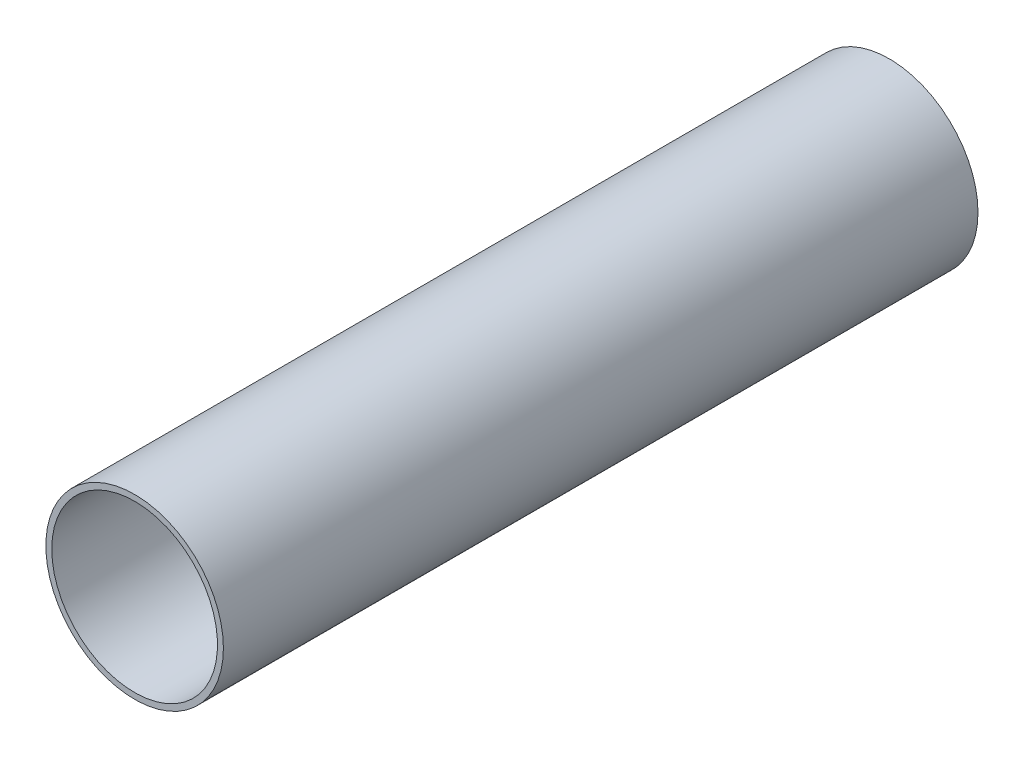
ISO-10303-21;
HEADER;
FILE_DESCRIPTION(('STEP AP214'),'2;1');
FILE_NAME('part.step','',(''),(''),'','','');
FILE_SCHEMA(('AUTOMOTIVE_DESIGN { 1 0 10303 214 1 1 1 1 }'));
ENDSEC;
DATA;
#1=APPLICATION_CONTEXT('core data for automotive mechanical design processes');
#2=APPLICATION_PROTOCOL_DEFINITION('international standard','automotive_design',2000,#1);
#3=PRODUCT_CONTEXT('',#1,'mechanical');
#4=PRODUCT('Part','Part','',(#3));
#5=PRODUCT_RELATED_PRODUCT_CATEGORY('part','',(#4));
#6=PRODUCT_DEFINITION_FORMATION('','',#4);
#7=PRODUCT_DEFINITION_CONTEXT('part definition',#1,'design');
#8=PRODUCT_DEFINITION('design','',#6,#7);
#9=PRODUCT_DEFINITION_SHAPE('','',#8);
#10=(LENGTH_UNIT() NAMED_UNIT(*) SI_UNIT(.MILLI.,.METRE.));
#11=(NAMED_UNIT(*) PLANE_ANGLE_UNIT() SI_UNIT($,.RADIAN.));
#12=(NAMED_UNIT(*) SI_UNIT($,.STERADIAN.) SOLID_ANGLE_UNIT());
#13=UNCERTAINTY_MEASURE_WITH_UNIT(LENGTH_MEASURE(1.E-05),#10,'distance_accuracy_value','');
#14=(GEOMETRIC_REPRESENTATION_CONTEXT(3) GLOBAL_UNCERTAINTY_ASSIGNED_CONTEXT((#13)) GLOBAL_UNIT_ASSIGNED_CONTEXT((#10,
#11,#12)) REPRESENTATION_CONTEXT('',''));
#15=CARTESIAN_POINT('',(0.,0.,0.));
#16=DIRECTION('',(0.,0.,1.));
#17=DIRECTION('',(1.,0.,0.));
#18=AXIS2_PLACEMENT_3D('',#15,#16,#17);
#19=CARTESIAN_POINT('',(-13.8868166566674,18.2655426294905,431.8));
#20=DIRECTION('',(0.,0.,-1.));
#21=DIRECTION('',(-1.,0.,0.));
#22=AXIS2_PLACEMENT_3D('',#19,#20,#21);
#23=CYLINDRICAL_SURFACE('',#22,50.8);
#24=CARTESIAN_POINT('',(-13.8868166566674,18.2655426294905,431.8));
#25=DIRECTION('',(0.,0.,1.));
#26=DIRECTION('',(1.,0.,0.));
#27=AXIS2_PLACEMENT_3D('',#24,#25,#26);
#28=CIRCLE('',#27,50.8);
#29=CARTESIAN_POINT('',(36.9131833433326,18.2655426294905,431.8));
#30=VERTEX_POINT('',#29);
#31=EDGE_CURVE('E10',#30,#30,#28,.T.);
#32=ORIENTED_EDGE('',*,*,#31,.F.);
#33=EDGE_LOOP('',(#32));
#34=FACE_BOUND('',#33,.T.);
#35=CARTESIAN_POINT('',(-13.8868166566674,18.2655426294905,0.));
#36=DIRECTION('',(0.,0.,1.));
#37=DIRECTION('',(1.,0.,0.));
#38=AXIS2_PLACEMENT_3D('',#35,#36,#37);
#39=CIRCLE('',#38,50.8);
#40=CARTESIAN_POINT('',(36.9131833433326,18.2655426294905,0.));
#41=VERTEX_POINT('',#40);
#42=EDGE_CURVE('E40',#41,#41,#39,.T.);
#43=ORIENTED_EDGE('',*,*,#42,.T.);
#44=EDGE_LOOP('',(#43));
#45=FACE_BOUND('',#44,.T.);
#46=ADVANCED_FACE('F37',(#34,#45),#23,.T.);
#47=CARTESIAN_POINT('',(-13.8868166566674,18.2655426294905,431.8));
#48=DIRECTION('',(0.,0.,1.));
#49=DIRECTION('',(1.,0.,0.));
#50=AXIS2_PLACEMENT_3D('',#47,#48,#49);
#51=PLANE('',#50);
#52=CARTESIAN_POINT('',(-13.8868166566674,18.2655426294905,431.8));
#53=DIRECTION('',(0.,0.,-1.));
#54=DIRECTION('',(-1.,0.,0.));
#55=AXIS2_PLACEMENT_3D('',#52,#53,#54);
#56=CIRCLE('',#55,47.4188408189468);
#57=CARTESIAN_POINT('',(-61.3056574756142,18.2655426294905,431.8));
#58=VERTEX_POINT('',#57);
#59=EDGE_CURVE('E49',#58,#58,#56,.T.);
#60=ORIENTED_EDGE('',*,*,#59,.T.);
#61=EDGE_LOOP('',(#60));
#62=FACE_BOUND('',#61,.T.);
#63=ORIENTED_EDGE('',*,*,#31,.T.);
#64=EDGE_LOOP('',(#63));
#65=FACE_BOUND('',#64,.T.);
#66=ADVANCED_FACE('F59',(#62,#65),#51,.T.);
#67=CARTESIAN_POINT('',(-13.8868166566674,18.2655426294905,0.));
#68=DIRECTION('',(0.,0.,1.));
#69=DIRECTION('',(1.,0.,0.));
#70=AXIS2_PLACEMENT_3D('',#67,#68,#69);
#71=PLANE('',#70);
#72=CARTESIAN_POINT('',(-13.8868166566674,18.2655426294905,0.));
#73=DIRECTION('',(0.,0.,-1.));
#74=DIRECTION('',(-1.,0.,0.));
#75=AXIS2_PLACEMENT_3D('',#72,#73,#74);
#76=CIRCLE('',#75,47.4188408189468);
#77=CARTESIAN_POINT('',(-61.3056574756142,18.2655426294905,0.));
#78=VERTEX_POINT('',#77);
#79=EDGE_CURVE('E51',#78,#78,#76,.T.);
#80=ORIENTED_EDGE('',*,*,#79,.F.);
#81=EDGE_LOOP('',(#80));
#82=FACE_BOUND('',#81,.T.);
#83=ORIENTED_EDGE('',*,*,#42,.F.);
#84=EDGE_LOOP('',(#83));
#85=FACE_BOUND('',#84,.T.);
#86=ADVANCED_FACE('F64',(#82,#85),#71,.F.);
#87=CARTESIAN_POINT('',(-13.8868166566674,18.2655426294905,431.8));
#88=DIRECTION('',(0.,0.,-1.));
#89=DIRECTION('',(-1.,0.,0.));
#90=AXIS2_PLACEMENT_3D('',#87,#88,#89);
#91=CYLINDRICAL_SURFACE('',#90,47.4188408189468);
#92=ORIENTED_EDGE('',*,*,#59,.F.);
#93=EDGE_LOOP('',(#92));
#94=FACE_BOUND('',#93,.T.);
#95=ORIENTED_EDGE('',*,*,#79,.T.);
#96=EDGE_LOOP('',(#95));
#97=FACE_BOUND('',#96,.T.);
#98=ADVANCED_FACE('F61',(#94,#97),#91,.F.);
#99=CLOSED_SHELL('',(#46,#66,#86,#98));
#100=MANIFOLD_SOLID_BREP('B2',#99);
#101=ADVANCED_BREP_SHAPE_REPRESENTATION('',(#18,#100),#14);
#102=SHAPE_DEFINITION_REPRESENTATION(#9,#101);
ENDSEC;
END-ISO-10303-21;
